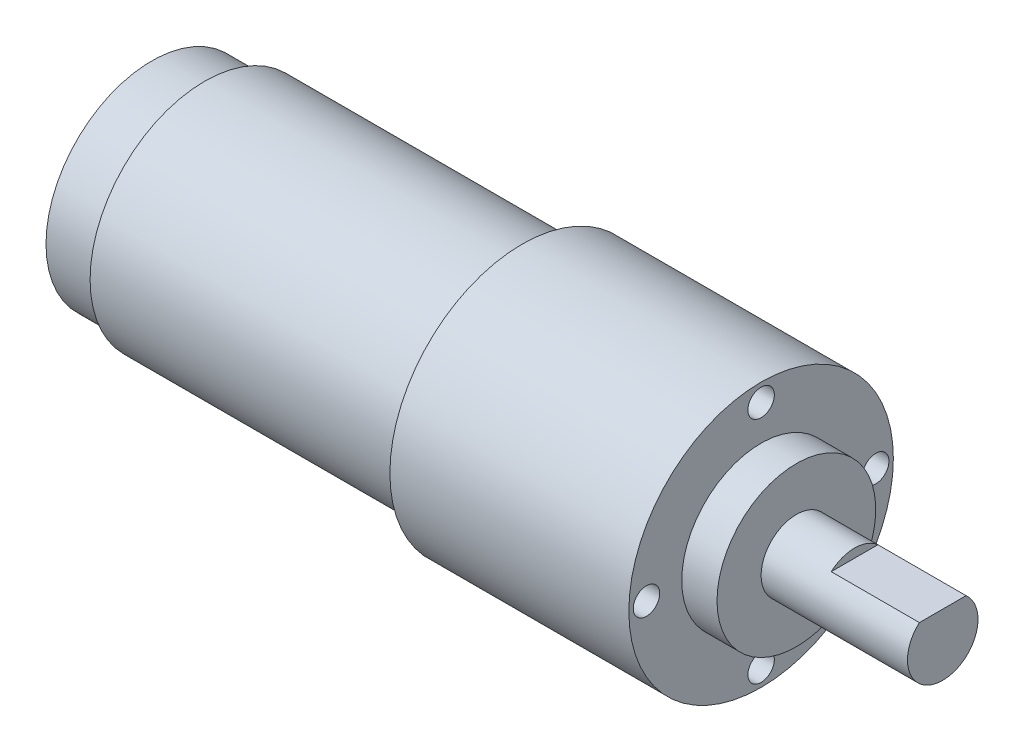
ISO-10303-21;
HEADER;
FILE_DESCRIPTION(('STEP AP214'),'2;1');
FILE_NAME('part.step','',(''),(''),'','','');
FILE_SCHEMA(('AUTOMOTIVE_DESIGN { 1 0 10303 214 1 1 1 1 }'));
ENDSEC;
DATA;
#1=APPLICATION_CONTEXT('core data for automotive mechanical design processes');
#2=APPLICATION_PROTOCOL_DEFINITION('international standard','automotive_design',2000,#1);
#3=PRODUCT_CONTEXT('',#1,'mechanical');
#4=PRODUCT('Part','Part','',(#3));
#5=PRODUCT_RELATED_PRODUCT_CATEGORY('part','',(#4));
#6=PRODUCT_DEFINITION_FORMATION('','',#4);
#7=PRODUCT_DEFINITION_CONTEXT('part definition',#1,'design');
#8=PRODUCT_DEFINITION('design','',#6,#7);
#9=PRODUCT_DEFINITION_SHAPE('','',#8);
#10=(LENGTH_UNIT() NAMED_UNIT(*) SI_UNIT(.MILLI.,.METRE.));
#11=(NAMED_UNIT(*) PLANE_ANGLE_UNIT() SI_UNIT($,.RADIAN.));
#12=(NAMED_UNIT(*) SI_UNIT($,.STERADIAN.) SOLID_ANGLE_UNIT());
#13=UNCERTAINTY_MEASURE_WITH_UNIT(LENGTH_MEASURE(1.E-05),#10,'distance_accuracy_value','');
#14=(GEOMETRIC_REPRESENTATION_CONTEXT(3) GLOBAL_UNCERTAINTY_ASSIGNED_CONTEXT((#13)) GLOBAL_UNIT_ASSIGNED_CONTEXT((#10,
#11,#12)) REPRESENTATION_CONTEXT('',''));
#15=CARTESIAN_POINT('',(0.,0.,0.));
#16=DIRECTION('',(0.,0.,1.));
#17=DIRECTION('',(1.,0.,0.));
#18=AXIS2_PLACEMENT_3D('',#15,#16,#17);
#19=CARTESIAN_POINT('',(0.,2.,0.));
#20=DIRECTION('',(1.,0.,0.));
#21=DIRECTION('',(0.,0.,-1.));
#22=AXIS2_PLACEMENT_3D('',#19,#20,#21);
#23=PLANE('',#22);
#24=CARTESIAN_POINT('',(0.,0.,0.));
#25=DIRECTION('',(-1.,0.,0.));
#26=DIRECTION('',(0.,0.,1.));
#27=AXIS2_PLACEMENT_3D('',#24,#25,#26);
#28=CIRCLE('',#27,2.);
#29=CARTESIAN_POINT('',(0.,0.,2.));
#30=VERTEX_POINT('',#29);
#31=EDGE_CURVE('E103',#30,#30,#28,.T.);
#32=ORIENTED_EDGE('',*,*,#31,.T.);
#33=EDGE_LOOP('',(#32));
#34=FACE_BOUND('',#33,.T.);
#35=ADVANCED_FACE('F33',(#34),#23,.F.);
#36=CARTESIAN_POINT('',(93.7,0.,0.));
#37=DIRECTION('',(-1.,0.,0.));
#38=DIRECTION('',(0.,0.,1.));
#39=AXIS2_PLACEMENT_3D('',#36,#37,#38);
#40=PLANE('',#39);
#41=CARTESIAN_POINT('',(93.7,0.,0.));
#42=DIRECTION('',(-1.,0.,0.));
#43=DIRECTION('',(0.,0.,1.));
#44=AXIS2_PLACEMENT_3D('',#41,#42,#43);
#45=CIRCLE('',#44,4.);
#46=CARTESIAN_POINT('',(93.7,3.,-2.64575131106459));
#47=VERTEX_POINT('',#46);
#48=CARTESIAN_POINT('',(93.7,3.,2.64575131106459));
#49=VERTEX_POINT('',#48);
#50=EDGE_CURVE('E40',#47,#49,#45,.T.);
#51=ORIENTED_EDGE('',*,*,#50,.F.);
#52=DIRECTION('',(0.,0.,-1.));
#53=VECTOR('',#52,1.);
#54=CARTESIAN_POINT('',(93.7,3.,2.64575131106459));
#55=LINE('',#54,#53);
#56=EDGE_CURVE('E59',#49,#47,#55,.T.);
#57=ORIENTED_EDGE('',*,*,#56,.F.);
#58=EDGE_LOOP('',(#51,#57));
#59=FACE_BOUND('',#58,.T.);
#60=ADVANCED_FACE('F67',(#59),#40,.F.);
#61=CARTESIAN_POINT('',(0.,0.,0.));
#62=DIRECTION('',(-1.,0.,0.));
#63=DIRECTION('',(0.,0.,1.));
#64=AXIS2_PLACEMENT_3D('',#61,#62,#63);
#65=CYLINDRICAL_SURFACE('',#64,4.);
#66=ORIENTED_EDGE('',*,*,#50,.T.);
#67=DIRECTION('',(1.,0.,0.));
#68=VECTOR('',#67,1.);
#69=CARTESIAN_POINT('',(83.7,3.,2.64575131106459));
#70=LINE('',#69,#68);
#71=CARTESIAN_POINT('',(83.7,3.,2.64575131106459));
#72=VERTEX_POINT('',#71);
#73=EDGE_CURVE('E56',#72,#49,#70,.T.);
#74=ORIENTED_EDGE('',*,*,#73,.F.);
#75=CARTESIAN_POINT('',(83.7,0.,0.));
#76=DIRECTION('',(-1.,0.,0.));
#77=DIRECTION('',(0.,0.,1.));
#78=AXIS2_PLACEMENT_3D('',#75,#76,#77);
#79=CIRCLE('',#78,4.);
#80=CARTESIAN_POINT('',(83.7,3.,-2.64575131106459));
#81=VERTEX_POINT('',#80);
#82=EDGE_CURVE('E11',#72,#81,#79,.T.);
#83=ORIENTED_EDGE('',*,*,#82,.T.);
#84=DIRECTION('',(1.,0.,0.));
#85=VECTOR('',#84,1.);
#86=CARTESIAN_POINT('',(83.7,3.,-2.64575131106459));
#87=LINE('',#86,#85);
#88=EDGE_CURVE('E63',#81,#47,#87,.T.);
#89=ORIENTED_EDGE('',*,*,#88,.T.);
#90=EDGE_LOOP('',(#66,#74,#83,#89));
#91=FACE_BOUND('',#90,.T.);
#92=CARTESIAN_POINT('',(77.1,0.,0.));
#93=DIRECTION('',(-1.,0.,0.));
#94=DIRECTION('',(0.,0.,1.));
#95=AXIS2_PLACEMENT_3D('',#92,#93,#94);
#96=CIRCLE('',#95,4.);
#97=CARTESIAN_POINT('',(77.1,0.,4.));
#98=VERTEX_POINT('',#97);
#99=EDGE_CURVE('E72',#98,#98,#96,.T.);
#100=ORIENTED_EDGE('',*,*,#99,.F.);
#101=EDGE_LOOP('',(#100));
#102=FACE_BOUND('',#101,.T.);
#103=ADVANCED_FACE('F70',(#91,#102),#65,.T.);
#104=CARTESIAN_POINT('',(77.1,4.,0.));
#105=DIRECTION('',(-1.,0.,0.));
#106=DIRECTION('',(0.,0.,1.));
#107=AXIS2_PLACEMENT_3D('',#104,#105,#106);
#108=PLANE('',#107);
#109=CARTESIAN_POINT('',(77.1,0.,0.));
#110=DIRECTION('',(-1.,0.,0.));
#111=DIRECTION('',(0.,0.,1.));
#112=AXIS2_PLACEMENT_3D('',#109,#110,#111);
#113=CIRCLE('',#112,9.);
#114=CARTESIAN_POINT('',(77.1,0.,9.));
#115=VERTEX_POINT('',#114);
#116=EDGE_CURVE('E74',#115,#115,#113,.T.);
#117=ORIENTED_EDGE('',*,*,#116,.F.);
#118=EDGE_LOOP('',(#117));
#119=FACE_BOUND('',#118,.T.);
#120=ORIENTED_EDGE('',*,*,#99,.T.);
#121=EDGE_LOOP('',(#120));
#122=FACE_BOUND('',#121,.T.);
#123=ADVANCED_FACE('F159',(#119,#122),#108,.F.);
#124=CARTESIAN_POINT('',(0.,0.,0.));
#125=DIRECTION('',(-1.,0.,0.));
#126=DIRECTION('',(0.,0.,1.));
#127=AXIS2_PLACEMENT_3D('',#124,#125,#126);
#128=CYLINDRICAL_SURFACE('',#127,9.);
#129=CARTESIAN_POINT('',(73.1,0.,0.));
#130=DIRECTION('',(-1.,0.,0.));
#131=DIRECTION('',(0.,0.,1.));
#132=AXIS2_PLACEMENT_3D('',#129,#130,#131);
#133=CIRCLE('',#132,9.);
#134=CARTESIAN_POINT('',(73.1,0.,9.));
#135=VERTEX_POINT('',#134);
#136=EDGE_CURVE('E79',#135,#135,#133,.T.);
#137=ORIENTED_EDGE('',*,*,#136,.F.);
#138=EDGE_LOOP('',(#137));
#139=FACE_BOUND('',#138,.T.);
#140=ORIENTED_EDGE('',*,*,#116,.T.);
#141=EDGE_LOOP('',(#140));
#142=FACE_BOUND('',#141,.T.);
#143=ADVANCED_FACE('F145',(#139,#142),#128,.T.);
#144=CARTESIAN_POINT('',(73.1,9.,0.));
#145=DIRECTION('',(-1.,0.,0.));
#146=DIRECTION('',(0.,0.,1.));
#147=AXIS2_PLACEMENT_3D('',#144,#145,#146);
#148=PLANE('',#147);
#149=CARTESIAN_POINT('',(73.1,1.36167772214882E-13,-13.));
#150=DIRECTION('',(1.,0.,0.));
#151=DIRECTION('',(0.,-1.,0.));
#152=AXIS2_PLACEMENT_3D('',#149,#150,#151);
#153=CIRCLE('',#152,1.5);
#154=CARTESIAN_POINT('',(73.1,-1.49999999999986,-13.));
#155=VERTEX_POINT('',#154);
#156=EDGE_CURVE('E126',#155,#155,#153,.T.);
#157=ORIENTED_EDGE('',*,*,#156,.F.);
#158=EDGE_LOOP('',(#157));
#159=FACE_BOUND('',#158,.T.);
#160=CARTESIAN_POINT('',(73.1,-13.,0.));
#161=DIRECTION('',(1.,0.,0.));
#162=DIRECTION('',(0.,0.,1.));
#163=AXIS2_PLACEMENT_3D('',#160,#161,#162);
#164=CIRCLE('',#163,1.5);
#165=CARTESIAN_POINT('',(73.1,-13.,1.5));
#166=VERTEX_POINT('',#165);
#167=EDGE_CURVE('E120',#166,#166,#164,.T.);
#168=ORIENTED_EDGE('',*,*,#167,.F.);
#169=EDGE_LOOP('',(#168));
#170=FACE_BOUND('',#169,.T.);
#171=CARTESIAN_POINT('',(73.1,0.,13.));
#172=DIRECTION('',(1.,0.,0.));
#173=DIRECTION('',(0.,1.,0.));
#174=AXIS2_PLACEMENT_3D('',#171,#172,#173);
#175=CIRCLE('',#174,1.5);
#176=CARTESIAN_POINT('',(73.1,1.49999999999995,13.));
#177=VERTEX_POINT('',#176);
#178=EDGE_CURVE('E114',#177,#177,#175,.T.);
#179=ORIENTED_EDGE('',*,*,#178,.F.);
#180=EDGE_LOOP('',(#179));
#181=FACE_BOUND('',#180,.T.);
#182=CARTESIAN_POINT('',(73.1,13.,0.));
#183=DIRECTION('',(1.,0.,0.));
#184=DIRECTION('',(0.,0.,-1.));
#185=AXIS2_PLACEMENT_3D('',#182,#183,#184);
#186=CIRCLE('',#185,1.5);
#187=CARTESIAN_POINT('',(73.1,13.,-1.5));
#188=VERTEX_POINT('',#187);
#189=EDGE_CURVE('E108',#188,#188,#186,.T.);
#190=ORIENTED_EDGE('',*,*,#189,.F.);
#191=EDGE_LOOP('',(#190));
#192=FACE_BOUND('',#191,.T.);
#193=CARTESIAN_POINT('',(73.1,0.,0.));
#194=DIRECTION('',(-1.,0.,0.));
#195=DIRECTION('',(0.,0.,1.));
#196=AXIS2_PLACEMENT_3D('',#193,#194,#195);
#197=CIRCLE('',#196,15.);
#198=CARTESIAN_POINT('',(73.1,0.,15.));
#199=VERTEX_POINT('',#198);
#200=EDGE_CURVE('E82',#199,#199,#197,.T.);
#201=ORIENTED_EDGE('',*,*,#200,.F.);
#202=EDGE_LOOP('',(#201));
#203=FACE_BOUND('',#202,.T.);
#204=ORIENTED_EDGE('',*,*,#136,.T.);
#205=EDGE_LOOP('',(#204));
#206=FACE_BOUND('',#205,.T.);
#207=ADVANCED_FACE('F141',(#159,#170,#181,#192,#203,#206),#148,.F.);
#208=CARTESIAN_POINT('',(0.,0.,0.));
#209=DIRECTION('',(-1.,0.,0.));
#210=DIRECTION('',(0.,0.,1.));
#211=AXIS2_PLACEMENT_3D('',#208,#209,#210);
#212=CYLINDRICAL_SURFACE('',#211,15.);
#213=CARTESIAN_POINT('',(46.,0.,0.));
#214=DIRECTION('',(-1.,0.,0.));
#215=DIRECTION('',(0.,0.,1.));
#216=AXIS2_PLACEMENT_3D('',#213,#214,#215);
#217=CIRCLE('',#216,15.);
#218=CARTESIAN_POINT('',(46.,0.,15.));
#219=VERTEX_POINT('',#218);
#220=EDGE_CURVE('E85',#219,#219,#217,.T.);
#221=ORIENTED_EDGE('',*,*,#220,.F.);
#222=EDGE_LOOP('',(#221));
#223=FACE_BOUND('',#222,.T.);
#224=ORIENTED_EDGE('',*,*,#200,.T.);
#225=EDGE_LOOP('',(#224));
#226=FACE_BOUND('',#225,.T.);
#227=ADVANCED_FACE('F144',(#223,#226),#212,.T.);
#228=CARTESIAN_POINT('',(46.,15.,0.));
#229=DIRECTION('',(1.,0.,0.));
#230=DIRECTION('',(0.,0.,-1.));
#231=AXIS2_PLACEMENT_3D('',#228,#229,#230);
#232=PLANE('',#231);
#233=CARTESIAN_POINT('',(46.,0.,0.));
#234=DIRECTION('',(-1.,0.,0.));
#235=DIRECTION('',(0.,0.,1.));
#236=AXIS2_PLACEMENT_3D('',#233,#234,#235);
#237=CIRCLE('',#236,13.);
#238=CARTESIAN_POINT('',(46.,0.,13.));
#239=VERTEX_POINT('',#238);
#240=EDGE_CURVE('E88',#239,#239,#237,.T.);
#241=ORIENTED_EDGE('',*,*,#240,.F.);
#242=EDGE_LOOP('',(#241));
#243=FACE_BOUND('',#242,.T.);
#244=ORIENTED_EDGE('',*,*,#220,.T.);
#245=EDGE_LOOP('',(#244));
#246=FACE_BOUND('',#245,.T.);
#247=ADVANCED_FACE('F206',(#243,#246),#232,.F.);
#248=CARTESIAN_POINT('',(0.,0.,0.));
#249=DIRECTION('',(-1.,0.,0.));
#250=DIRECTION('',(0.,0.,1.));
#251=AXIS2_PLACEMENT_3D('',#248,#249,#250);
#252=CYLINDRICAL_SURFACE('',#251,13.);
#253=CARTESIAN_POINT('',(10.,0.,0.));
#254=DIRECTION('',(-1.,0.,0.));
#255=DIRECTION('',(0.,0.,1.));
#256=AXIS2_PLACEMENT_3D('',#253,#254,#255);
#257=CIRCLE('',#256,13.);
#258=CARTESIAN_POINT('',(10.,0.,13.));
#259=VERTEX_POINT('',#258);
#260=EDGE_CURVE('E91',#259,#259,#257,.T.);
#261=ORIENTED_EDGE('',*,*,#260,.F.);
#262=EDGE_LOOP('',(#261));
#263=FACE_BOUND('',#262,.T.);
#264=ORIENTED_EDGE('',*,*,#240,.T.);
#265=EDGE_LOOP('',(#264));
#266=FACE_BOUND('',#265,.T.);
#267=ADVANCED_FACE('F200',(#263,#266),#252,.T.);
#268=CARTESIAN_POINT('',(10.,13.,0.));
#269=DIRECTION('',(1.,0.,0.));
#270=DIRECTION('',(0.,0.,-1.));
#271=AXIS2_PLACEMENT_3D('',#268,#269,#270);
#272=PLANE('',#271);
#273=CARTESIAN_POINT('',(10.,0.,0.));
#274=DIRECTION('',(-1.,0.,0.));
#275=DIRECTION('',(0.,0.,1.));
#276=AXIS2_PLACEMENT_3D('',#273,#274,#275);
#277=CIRCLE('',#276,12.);
#278=CARTESIAN_POINT('',(10.,0.,12.));
#279=VERTEX_POINT('',#278);
#280=EDGE_CURVE('E94',#279,#279,#277,.T.);
#281=ORIENTED_EDGE('',*,*,#280,.F.);
#282=EDGE_LOOP('',(#281));
#283=FACE_BOUND('',#282,.T.);
#284=ORIENTED_EDGE('',*,*,#260,.T.);
#285=EDGE_LOOP('',(#284));
#286=FACE_BOUND('',#285,.T.);
#287=ADVANCED_FACE('F194',(#283,#286),#272,.F.);
#288=CARTESIAN_POINT('',(0.,0.,0.));
#289=DIRECTION('',(-1.,0.,0.));
#290=DIRECTION('',(0.,0.,1.));
#291=AXIS2_PLACEMENT_3D('',#288,#289,#290);
#292=CYLINDRICAL_SURFACE('',#291,12.);
#293=CARTESIAN_POINT('',(4.,0.,0.));
#294=DIRECTION('',(-1.,0.,0.));
#295=DIRECTION('',(0.,0.,1.));
#296=AXIS2_PLACEMENT_3D('',#293,#294,#295);
#297=CIRCLE('',#296,12.);
#298=CARTESIAN_POINT('',(4.,0.,12.));
#299=VERTEX_POINT('',#298);
#300=EDGE_CURVE('E97',#299,#299,#297,.T.);
#301=ORIENTED_EDGE('',*,*,#300,.F.);
#302=EDGE_LOOP('',(#301));
#303=FACE_BOUND('',#302,.T.);
#304=ORIENTED_EDGE('',*,*,#280,.T.);
#305=EDGE_LOOP('',(#304));
#306=FACE_BOUND('',#305,.T.);
#307=ADVANCED_FACE('F188',(#303,#306),#292,.T.);
#308=CARTESIAN_POINT('',(4.,12.,0.));
#309=DIRECTION('',(1.,0.,0.));
#310=DIRECTION('',(0.,0.,-1.));
#311=AXIS2_PLACEMENT_3D('',#308,#309,#310);
#312=PLANE('',#311);
#313=CARTESIAN_POINT('',(4.,0.,0.));
#314=DIRECTION('',(-1.,0.,0.));
#315=DIRECTION('',(0.,0.,1.));
#316=AXIS2_PLACEMENT_3D('',#313,#314,#315);
#317=CIRCLE('',#316,2.);
#318=CARTESIAN_POINT('',(4.,0.,2.));
#319=VERTEX_POINT('',#318);
#320=EDGE_CURVE('E100',#319,#319,#317,.T.);
#321=ORIENTED_EDGE('',*,*,#320,.F.);
#322=EDGE_LOOP('',(#321));
#323=FACE_BOUND('',#322,.T.);
#324=ORIENTED_EDGE('',*,*,#300,.T.);
#325=EDGE_LOOP('',(#324));
#326=FACE_BOUND('',#325,.T.);
#327=ADVANCED_FACE('F182',(#323,#326),#312,.F.);
#328=CARTESIAN_POINT('',(0.,0.,0.));
#329=DIRECTION('',(-1.,0.,0.));
#330=DIRECTION('',(0.,0.,1.));
#331=AXIS2_PLACEMENT_3D('',#328,#329,#330);
#332=CYLINDRICAL_SURFACE('',#331,2.);
#333=ORIENTED_EDGE('',*,*,#31,.F.);
#334=EDGE_LOOP('',(#333));
#335=FACE_BOUND('',#334,.T.);
#336=ORIENTED_EDGE('',*,*,#320,.T.);
#337=EDGE_LOOP('',(#336));
#338=FACE_BOUND('',#337,.T.);
#339=ADVANCED_FACE('F178',(#335,#338),#332,.T.);
#340=CARTESIAN_POINT('',(83.7,0.,0.));
#341=DIRECTION('',(-1.,0.,0.));
#342=DIRECTION('',(0.,0.,1.));
#343=AXIS2_PLACEMENT_3D('',#340,#341,#342);
#344=PLANE('',#343);
#345=DIRECTION('',(0.,0.,-1.));
#346=VECTOR('',#345,1.);
#347=CARTESIAN_POINT('',(83.7,3.,2.64575131106459));
#348=LINE('',#347,#346);
#349=EDGE_CURVE('E46',#72,#81,#348,.T.);
#350=ORIENTED_EDGE('',*,*,#349,.T.);
#351=ORIENTED_EDGE('',*,*,#82,.F.);
#352=EDGE_LOOP('',(#350,#351));
#353=FACE_BOUND('',#352,.T.);
#354=ADVANCED_FACE('F181',(#353),#344,.F.);
#355=CARTESIAN_POINT('',(83.7,3.,2.64575131106459));
#356=DIRECTION('',(0.,-1.,0.));
#357=DIRECTION('',(0.,0.,-1.));
#358=AXIS2_PLACEMENT_3D('',#355,#356,#357);
#359=PLANE('',#358);
#360=ORIENTED_EDGE('',*,*,#56,.T.);
#361=ORIENTED_EDGE('',*,*,#88,.F.);
#362=ORIENTED_EDGE('',*,*,#349,.F.);
#363=ORIENTED_EDGE('',*,*,#73,.T.);
#364=EDGE_LOOP('',(#360,#361,#362,#363));
#365=FACE_BOUND('',#364,.T.);
#366=ADVANCED_FACE('F58',(#365),#359,.F.);
#367=CARTESIAN_POINT('',(70.1,13.,0.));
#368=DIRECTION('',(1.,0.,0.));
#369=DIRECTION('',(0.,0.,-1.));
#370=AXIS2_PLACEMENT_3D('',#367,#368,#369);
#371=CYLINDRICAL_SURFACE('',#370,1.5);
#372=CARTESIAN_POINT('',(70.1,13.,0.));
#373=DIRECTION('',(1.,0.,0.));
#374=DIRECTION('',(0.,0.,-1.));
#375=AXIS2_PLACEMENT_3D('',#372,#373,#374);
#376=CIRCLE('',#375,1.5);
#377=CARTESIAN_POINT('',(70.1,13.,-1.5));
#378=VERTEX_POINT('',#377);
#379=EDGE_CURVE('E68',#378,#378,#376,.T.);
#380=ORIENTED_EDGE('',*,*,#379,.F.);
#381=EDGE_LOOP('',(#380));
#382=FACE_BOUND('',#381,.T.);
#383=ORIENTED_EDGE('',*,*,#189,.T.);
#384=EDGE_LOOP('',(#383));
#385=FACE_BOUND('',#384,.T.);
#386=ADVANCED_FACE('F223',(#382,#385),#371,.F.);
#387=CARTESIAN_POINT('',(70.1,13.,0.));
#388=DIRECTION('',(1.,0.,0.));
#389=DIRECTION('',(0.,0.,-1.));
#390=AXIS2_PLACEMENT_3D('',#387,#388,#389);
#391=PLANE('',#390);
#392=ORIENTED_EDGE('',*,*,#379,.T.);
#393=EDGE_LOOP('',(#392));
#394=FACE_BOUND('',#393,.T.);
#395=ADVANCED_FACE('F228',(#394),#391,.T.);
#396=CARTESIAN_POINT('',(70.1,0.,13.));
#397=DIRECTION('',(1.,0.,0.));
#398=DIRECTION('',(0.,0.,-1.));
#399=AXIS2_PLACEMENT_3D('',#396,#397,#398);
#400=CYLINDRICAL_SURFACE('',#399,1.5);
#401=CARTESIAN_POINT('',(70.1,0.,13.));
#402=DIRECTION('',(1.,0.,0.));
#403=DIRECTION('',(0.,1.,0.));
#404=AXIS2_PLACEMENT_3D('',#401,#402,#403);
#405=CIRCLE('',#404,1.5);
#406=CARTESIAN_POINT('',(70.1,1.49999999999995,13.));
#407=VERTEX_POINT('',#406);
#408=EDGE_CURVE('E111',#407,#407,#405,.T.);
#409=ORIENTED_EDGE('',*,*,#408,.F.);
#410=EDGE_LOOP('',(#409));
#411=FACE_BOUND('',#410,.T.);
#412=ORIENTED_EDGE('',*,*,#178,.T.);
#413=EDGE_LOOP('',(#412));
#414=FACE_BOUND('',#413,.T.);
#415=ADVANCED_FACE('F232',(#411,#414),#400,.F.);
#416=CARTESIAN_POINT('',(70.1,0.,13.));
#417=DIRECTION('',(1.,0.,0.));
#418=DIRECTION('',(0.,1.,0.));
#419=AXIS2_PLACEMENT_3D('',#416,#417,#418);
#420=PLANE('',#419);
#421=ORIENTED_EDGE('',*,*,#408,.T.);
#422=EDGE_LOOP('',(#421));
#423=FACE_BOUND('',#422,.T.);
#424=ADVANCED_FACE('F236',(#423),#420,.T.);
#425=CARTESIAN_POINT('',(70.1,-13.,0.));
#426=DIRECTION('',(1.,0.,0.));
#427=DIRECTION('',(0.,0.,-1.));
#428=AXIS2_PLACEMENT_3D('',#425,#426,#427);
#429=CYLINDRICAL_SURFACE('',#428,1.5);
#430=CARTESIAN_POINT('',(70.1,-13.,0.));
#431=DIRECTION('',(1.,0.,0.));
#432=DIRECTION('',(0.,0.,1.));
#433=AXIS2_PLACEMENT_3D('',#430,#431,#432);
#434=CIRCLE('',#433,1.5);
#435=CARTESIAN_POINT('',(70.1,-13.,1.5));
#436=VERTEX_POINT('',#435);
#437=EDGE_CURVE('E117',#436,#436,#434,.T.);
#438=ORIENTED_EDGE('',*,*,#437,.F.);
#439=EDGE_LOOP('',(#438));
#440=FACE_BOUND('',#439,.T.);
#441=ORIENTED_EDGE('',*,*,#167,.T.);
#442=EDGE_LOOP('',(#441));
#443=FACE_BOUND('',#442,.T.);
#444=ADVANCED_FACE('F240',(#440,#443),#429,.F.);
#445=CARTESIAN_POINT('',(70.1,-13.,0.));
#446=DIRECTION('',(1.,0.,0.));
#447=DIRECTION('',(0.,0.,1.));
#448=AXIS2_PLACEMENT_3D('',#445,#446,#447);
#449=PLANE('',#448);
#450=ORIENTED_EDGE('',*,*,#437,.T.);
#451=EDGE_LOOP('',(#450));
#452=FACE_BOUND('',#451,.T.);
#453=ADVANCED_FACE('F137',(#452),#449,.T.);
#454=CARTESIAN_POINT('',(70.1,1.36167772214882E-13,-13.));
#455=DIRECTION('',(1.,0.,0.));
#456=DIRECTION('',(0.,0.,-1.));
#457=AXIS2_PLACEMENT_3D('',#454,#455,#456);
#458=CYLINDRICAL_SURFACE('',#457,1.5);
#459=CARTESIAN_POINT('',(70.1,1.36167772214882E-13,-13.));
#460=DIRECTION('',(1.,0.,0.));
#461=DIRECTION('',(0.,-1.,0.));
#462=AXIS2_PLACEMENT_3D('',#459,#460,#461);
#463=CIRCLE('',#462,1.5);
#464=CARTESIAN_POINT('',(70.1,-1.49999999999986,-13.));
#465=VERTEX_POINT('',#464);
#466=EDGE_CURVE('E123',#465,#465,#463,.T.);
#467=ORIENTED_EDGE('',*,*,#466,.F.);
#468=EDGE_LOOP('',(#467));
#469=FACE_BOUND('',#468,.T.);
#470=ORIENTED_EDGE('',*,*,#156,.T.);
#471=EDGE_LOOP('',(#470));
#472=FACE_BOUND('',#471,.T.);
#473=ADVANCED_FACE('F134',(#469,#472),#458,.F.);
#474=CARTESIAN_POINT('',(70.1,1.36167772214882E-13,-13.));
#475=DIRECTION('',(1.,0.,0.));
#476=DIRECTION('',(0.,-1.,0.));
#477=AXIS2_PLACEMENT_3D('',#474,#475,#476);
#478=PLANE('',#477);
#479=ORIENTED_EDGE('',*,*,#466,.T.);
#480=EDGE_LOOP('',(#479));
#481=FACE_BOUND('',#480,.T.);
#482=ADVANCED_FACE('F132',(#481),#478,.T.);
#483=CLOSED_SHELL('',(#35,#60,#103,#123,#143,#207,#227,#247,#267,#287,#307,#327,#339,#354,#366,
#386,#395,#415,#424,#444,#453,#473,#482));
#484=MANIFOLD_SOLID_BREP('B2',#483);
#485=ADVANCED_BREP_SHAPE_REPRESENTATION('',(#18,#484),#14);
#486=SHAPE_DEFINITION_REPRESENTATION(#9,#485);
ENDSEC;
END-ISO-10303-21;
